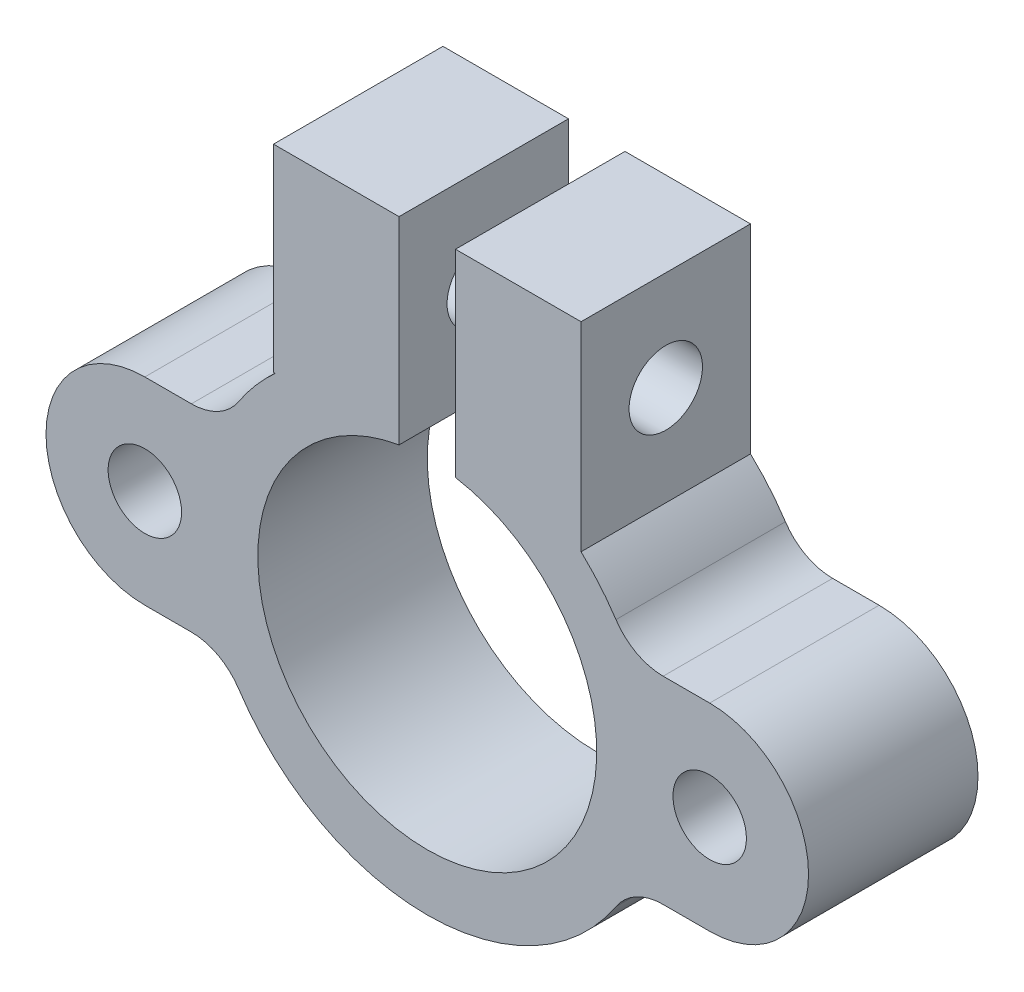
ISO-10303-21;
HEADER;
FILE_DESCRIPTION(('STEP AP214'),'2;1');
FILE_NAME('part.step','',(''),(''),'','','');
FILE_SCHEMA(('AUTOMOTIVE_DESIGN { 1 0 10303 214 1 1 1 1 }'));
ENDSEC;
DATA;
#1=APPLICATION_CONTEXT('core data for automotive mechanical design processes');
#2=APPLICATION_PROTOCOL_DEFINITION('international standard','automotive_design',2000,#1);
#3=PRODUCT_CONTEXT('',#1,'mechanical');
#4=PRODUCT('Part','Part','',(#3));
#5=PRODUCT_RELATED_PRODUCT_CATEGORY('part','',(#4));
#6=PRODUCT_DEFINITION_FORMATION('','',#4);
#7=PRODUCT_DEFINITION_CONTEXT('part definition',#1,'design');
#8=PRODUCT_DEFINITION('design','',#6,#7);
#9=PRODUCT_DEFINITION_SHAPE('','',#8);
#10=(LENGTH_UNIT() NAMED_UNIT(*) SI_UNIT(.MILLI.,.METRE.));
#11=(NAMED_UNIT(*) PLANE_ANGLE_UNIT() SI_UNIT($,.RADIAN.));
#12=(NAMED_UNIT(*) SI_UNIT($,.STERADIAN.) SOLID_ANGLE_UNIT());
#13=UNCERTAINTY_MEASURE_WITH_UNIT(LENGTH_MEASURE(1.E-05),#10,'distance_accuracy_value','');
#14=(GEOMETRIC_REPRESENTATION_CONTEXT(3) GLOBAL_UNCERTAINTY_ASSIGNED_CONTEXT((#13)) GLOBAL_UNIT_ASSIGNED_CONTEXT((#10,
#11,#12)) REPRESENTATION_CONTEXT('',''));
#15=CARTESIAN_POINT('',(0.,0.,0.));
#16=DIRECTION('',(0.,0.,1.));
#17=DIRECTION('',(1.,0.,0.));
#18=AXIS2_PLACEMENT_3D('',#15,#16,#17);
#19=CARTESIAN_POINT('',(0.,0.,6.));
#20=DIRECTION('',(0.,0.,1.));
#21=DIRECTION('',(1.,0.,0.));
#22=AXIS2_PLACEMENT_3D('',#19,#20,#21);
#23=PLANE('',#22);
#24=CARTESIAN_POINT('',(-10.,0.,6.));
#25=DIRECTION('',(0.,0.,1.));
#26=DIRECTION('',(1.,0.,0.));
#27=AXIS2_PLACEMENT_3D('',#24,#25,#26);
#28=CIRCLE('',#27,1.3);
#29=CARTESIAN_POINT('',(-8.7,0.,6.));
#30=VERTEX_POINT('',#29);
#31=EDGE_CURVE('E213',#30,#30,#28,.T.);
#32=ORIENTED_EDGE('',*,*,#31,.F.);
#33=EDGE_LOOP('',(#32));
#34=FACE_BOUND('',#33,.T.);
#35=CARTESIAN_POINT('',(0.,0.,6.));
#36=DIRECTION('',(0.,0.,-1.));
#37=DIRECTION('',(1.,0.,0.));
#38=AXIS2_PLACEMENT_3D('',#35,#36,#37);
#39=CIRCLE('',#38,6.);
#40=CARTESIAN_POINT('',(1.,5.91607978309962,6.));
#41=VERTEX_POINT('',#40);
#42=CARTESIAN_POINT('',(-1.,5.91607978309962,6.));
#43=VERTEX_POINT('',#42);
#44=EDGE_CURVE('E250',#41,#43,#39,.T.);
#45=ORIENTED_EDGE('',*,*,#44,.T.);
#46=DIRECTION('',(0.,1.,0.));
#47=VECTOR('',#46,1.);
#48=CARTESIAN_POINT('',(-1.,12.9160797830996,6.));
#49=LINE('',#48,#47);
#50=CARTESIAN_POINT('',(-1.,12.9160797830996,6.));
#51=VERTEX_POINT('',#50);
#52=EDGE_CURVE('E133',#43,#51,#49,.T.);
#53=ORIENTED_EDGE('',*,*,#52,.T.);
#54=DIRECTION('',(-1.,0.,0.));
#55=VECTOR('',#54,1.);
#56=CARTESIAN_POINT('',(-1.,12.9160797830996,6.));
#57=LINE('',#56,#55);
#58=CARTESIAN_POINT('',(-5.4447751227269,12.9160797830996,6.));
#59=VERTEX_POINT('',#58);
#60=EDGE_CURVE('E305',#51,#59,#57,.T.);
#61=ORIENTED_EDGE('',*,*,#60,.T.);
#62=DIRECTION('',(0.,-1.,0.));
#63=VECTOR('',#62,1.);
#64=CARTESIAN_POINT('',(-5.4447751227269,5.91607978309962,6.));
#65=LINE('',#64,#63);
#66=CARTESIAN_POINT('',(-5.4447751227269,5.91607978309962,6.));
#67=VERTEX_POINT('',#66);
#68=EDGE_CURVE('E324',#59,#67,#65,.T.);
#69=ORIENTED_EDGE('',*,*,#68,.T.);
#70=DIRECTION('',(1.,0.,0.));
#71=VECTOR('',#70,1.);
#72=CARTESIAN_POINT('',(-5.3851648071345,5.91607978309962,6.));
#73=LINE('',#72,#71);
#74=CARTESIAN_POINT('',(-5.3851648071345,5.91607978309962,6.));
#75=VERTEX_POINT('',#74);
#76=EDGE_CURVE('E321',#67,#75,#73,.T.);
#77=ORIENTED_EDGE('',*,*,#76,.T.);
#78=CARTESIAN_POINT('',(0.,0.,6.));
#79=DIRECTION('',(0.,0.,1.));
#80=DIRECTION('',(1.,0.,0.));
#81=AXIS2_PLACEMENT_3D('',#78,#79,#80);
#82=CIRCLE('',#81,8.);
#83=CARTESIAN_POINT('',(-6.68131723539603,4.4,6.));
#84=VERTEX_POINT('',#83);
#85=EDGE_CURVE('E323',#75,#84,#82,.T.);
#86=ORIENTED_EDGE('',*,*,#85,.T.);
#87=CARTESIAN_POINT('',(-8.35164654424504,5.5,6.));
#88=DIRECTION('',(0.,0.,-1.));
#89=DIRECTION('',(-1.,0.,0.));
#90=AXIS2_PLACEMENT_3D('',#87,#88,#89);
#91=CIRCLE('',#90,2.);
#92=CARTESIAN_POINT('',(-8.35164654424504,3.5,6.));
#93=VERTEX_POINT('',#92);
#94=EDGE_CURVE('E326',#84,#93,#91,.T.);
#95=ORIENTED_EDGE('',*,*,#94,.T.);
#96=DIRECTION('',(-1.,0.,0.));
#97=VECTOR('',#96,1.);
#98=CARTESIAN_POINT('',(-10.,3.5,6.));
#99=LINE('',#98,#97);
#100=CARTESIAN_POINT('',(-10.,3.5,6.));
#101=VERTEX_POINT('',#100);
#102=EDGE_CURVE('E332',#93,#101,#99,.T.);
#103=ORIENTED_EDGE('',*,*,#102,.T.);
#104=CARTESIAN_POINT('',(-10.,0.,6.));
#105=DIRECTION('',(0.,0.,1.));
#106=DIRECTION('',(1.,0.,0.));
#107=AXIS2_PLACEMENT_3D('',#104,#105,#106);
#108=CIRCLE('',#107,3.5);
#109=CARTESIAN_POINT('',(-10.,-3.5,6.));
#110=VERTEX_POINT('',#109);
#111=EDGE_CURVE('E334',#101,#110,#108,.T.);
#112=ORIENTED_EDGE('',*,*,#111,.T.);
#113=DIRECTION('',(1.,0.,0.));
#114=VECTOR('',#113,1.);
#115=CARTESIAN_POINT('',(-10.,-3.5,6.));
#116=LINE('',#115,#114);
#117=CARTESIAN_POINT('',(-8.35164654424504,-3.5,6.));
#118=VERTEX_POINT('',#117);
#119=EDGE_CURVE('E336',#110,#118,#116,.T.);
#120=ORIENTED_EDGE('',*,*,#119,.T.);
#121=CARTESIAN_POINT('',(-8.35164654424504,-5.5,6.));
#122=DIRECTION('',(0.,0.,-1.));
#123=DIRECTION('',(1.,0.,0.));
#124=AXIS2_PLACEMENT_3D('',#121,#122,#123);
#125=CIRCLE('',#124,2.);
#126=CARTESIAN_POINT('',(-6.68131723539603,-4.4,6.));
#127=VERTEX_POINT('',#126);
#128=EDGE_CURVE('E338',#118,#127,#125,.T.);
#129=ORIENTED_EDGE('',*,*,#128,.T.);
#130=CARTESIAN_POINT('',(0.,0.,6.));
#131=DIRECTION('',(0.,0.,1.));
#132=DIRECTION('',(1.,0.,0.));
#133=AXIS2_PLACEMENT_3D('',#130,#131,#132);
#134=CIRCLE('',#133,8.);
#135=CARTESIAN_POINT('',(6.68131723539603,-4.4,6.));
#136=VERTEX_POINT('',#135);
#137=EDGE_CURVE('E340',#127,#136,#134,.T.);
#138=ORIENTED_EDGE('',*,*,#137,.T.);
#139=CARTESIAN_POINT('',(8.35164654424504,-5.49999999999999,6.));
#140=DIRECTION('',(0.,0.,-1.));
#141=DIRECTION('',(1.,0.,0.));
#142=AXIS2_PLACEMENT_3D('',#139,#140,#141);
#143=CIRCLE('',#142,2.);
#144=CARTESIAN_POINT('',(8.35164654424504,-3.49999999999999,6.));
#145=VERTEX_POINT('',#144);
#146=EDGE_CURVE('E342',#136,#145,#143,.T.);
#147=ORIENTED_EDGE('',*,*,#146,.T.);
#148=DIRECTION('',(1.,0.,0.));
#149=VECTOR('',#148,1.);
#150=CARTESIAN_POINT('',(8.35164654424504,-3.49999999999999,6.));
#151=LINE('',#150,#149);
#152=CARTESIAN_POINT('',(10.,-3.5,6.));
#153=VERTEX_POINT('',#152);
#154=EDGE_CURVE('E344',#145,#153,#151,.T.);
#155=ORIENTED_EDGE('',*,*,#154,.T.);
#156=CARTESIAN_POINT('',(10.,0.,6.));
#157=DIRECTION('',(0.,0.,1.));
#158=DIRECTION('',(1.,0.,0.));
#159=AXIS2_PLACEMENT_3D('',#156,#157,#158);
#160=CIRCLE('',#159,3.5);
#161=CARTESIAN_POINT('',(10.,3.5,6.));
#162=VERTEX_POINT('',#161);
#163=EDGE_CURVE('E346',#153,#162,#160,.T.);
#164=ORIENTED_EDGE('',*,*,#163,.T.);
#165=DIRECTION('',(-1.,0.,0.));
#166=VECTOR('',#165,1.);
#167=CARTESIAN_POINT('',(8.35164654424504,3.5,6.));
#168=LINE('',#167,#166);
#169=CARTESIAN_POINT('',(8.35164654424504,3.5,6.));
#170=VERTEX_POINT('',#169);
#171=EDGE_CURVE('E348',#162,#170,#168,.T.);
#172=ORIENTED_EDGE('',*,*,#171,.T.);
#173=CARTESIAN_POINT('',(8.35164654424504,5.5,6.));
#174=DIRECTION('',(0.,0.,-1.));
#175=DIRECTION('',(1.,0.,0.));
#176=AXIS2_PLACEMENT_3D('',#173,#174,#175);
#177=CIRCLE('',#176,2.);
#178=CARTESIAN_POINT('',(6.68131723539603,4.4,6.));
#179=VERTEX_POINT('',#178);
#180=EDGE_CURVE('E350',#170,#179,#177,.T.);
#181=ORIENTED_EDGE('',*,*,#180,.T.);
#182=CARTESIAN_POINT('',(0.,0.,6.));
#183=DIRECTION('',(0.,0.,1.));
#184=DIRECTION('',(1.,0.,0.));
#185=AXIS2_PLACEMENT_3D('',#182,#183,#184);
#186=CIRCLE('',#185,8.);
#187=CARTESIAN_POINT('',(5.44477512272691,5.86126469824851,6.));
#188=VERTEX_POINT('',#187);
#189=EDGE_CURVE('E191',#179,#188,#186,.T.);
#190=ORIENTED_EDGE('',*,*,#189,.T.);
#191=DIRECTION('',(0.,1.,0.));
#192=VECTOR('',#191,1.);
#193=CARTESIAN_POINT('',(5.44477512272691,12.9160797830996,6.));
#194=LINE('',#193,#192);
#195=CARTESIAN_POINT('',(5.44477512272691,12.9160797830996,6.));
#196=VERTEX_POINT('',#195);
#197=EDGE_CURVE('E185',#188,#196,#194,.T.);
#198=ORIENTED_EDGE('',*,*,#197,.T.);
#199=DIRECTION('',(-1.,0.,0.));
#200=VECTOR('',#199,1.);
#201=CARTESIAN_POINT('',(1.,12.9160797830996,6.));
#202=LINE('',#201,#200);
#203=CARTESIAN_POINT('',(1.,12.9160797830996,6.));
#204=VERTEX_POINT('',#203);
#205=EDGE_CURVE('E189',#196,#204,#202,.T.);
#206=ORIENTED_EDGE('',*,*,#205,.T.);
#207=DIRECTION('',(0.,-1.,0.));
#208=VECTOR('',#207,1.);
#209=CARTESIAN_POINT('',(1.,12.9160797830996,6.));
#210=LINE('',#209,#208);
#211=EDGE_CURVE('E51',#204,#41,#210,.T.);
#212=ORIENTED_EDGE('',*,*,#211,.T.);
#213=EDGE_LOOP('',(#45,#53,#61,#69,#77,#86,#95,#103,#112,#120,#129,#138,#147,#155,#164,#172,
#181,#190,#198,#206,#212));
#214=FACE_BOUND('',#213,.T.);
#215=CARTESIAN_POINT('',(10.,0.,6.));
#216=DIRECTION('',(0.,0.,1.));
#217=DIRECTION('',(1.,0.,0.));
#218=AXIS2_PLACEMENT_3D('',#215,#216,#217);
#219=CIRCLE('',#218,1.3);
#220=CARTESIAN_POINT('',(11.3,0.,6.));
#221=VERTEX_POINT('',#220);
#222=EDGE_CURVE('E410',#221,#221,#219,.T.);
#223=ORIENTED_EDGE('',*,*,#222,.F.);
#224=EDGE_LOOP('',(#223));
#225=FACE_BOUND('',#224,.T.);
#226=ADVANCED_FACE('F33',(#34,#214,#225),#23,.T.);
#227=CARTESIAN_POINT('',(0.,0.,0.));
#228=DIRECTION('',(0.,0.,1.));
#229=DIRECTION('',(1.,0.,0.));
#230=AXIS2_PLACEMENT_3D('',#227,#228,#229);
#231=PLANE('',#230);
#232=CARTESIAN_POINT('',(-10.,0.,0.));
#233=DIRECTION('',(0.,0.,1.));
#234=DIRECTION('',(1.,0.,0.));
#235=AXIS2_PLACEMENT_3D('',#232,#233,#234);
#236=CIRCLE('',#235,1.3);
#237=CARTESIAN_POINT('',(-8.7,0.,0.));
#238=VERTEX_POINT('',#237);
#239=EDGE_CURVE('E416',#238,#238,#236,.T.);
#240=ORIENTED_EDGE('',*,*,#239,.T.);
#241=EDGE_LOOP('',(#240));
#242=FACE_BOUND('',#241,.T.);
#243=CARTESIAN_POINT('',(0.,0.,0.));
#244=DIRECTION('',(0.,0.,-1.));
#245=DIRECTION('',(1.,0.,0.));
#246=AXIS2_PLACEMENT_3D('',#243,#244,#245);
#247=CIRCLE('',#246,6.);
#248=CARTESIAN_POINT('',(1.,5.91607978309962,0.));
#249=VERTEX_POINT('',#248);
#250=CARTESIAN_POINT('',(-1.,5.91607978309962,0.));
#251=VERTEX_POINT('',#250);
#252=EDGE_CURVE('E209',#249,#251,#247,.T.);
#253=ORIENTED_EDGE('',*,*,#252,.F.);
#254=DIRECTION('',(0.,-1.,0.));
#255=VECTOR('',#254,1.);
#256=CARTESIAN_POINT('',(1.,12.9160797830996,0.));
#257=LINE('',#256,#255);
#258=CARTESIAN_POINT('',(1.,12.9160797830996,0.));
#259=VERTEX_POINT('',#258);
#260=EDGE_CURVE('E125',#259,#249,#257,.T.);
#261=ORIENTED_EDGE('',*,*,#260,.F.);
#262=DIRECTION('',(-1.,0.,0.));
#263=VECTOR('',#262,1.);
#264=CARTESIAN_POINT('',(1.,12.9160797830996,0.));
#265=LINE('',#264,#263);
#266=CARTESIAN_POINT('',(5.44477512272691,12.9160797830996,0.));
#267=VERTEX_POINT('',#266);
#268=EDGE_CURVE('E119',#267,#259,#265,.T.);
#269=ORIENTED_EDGE('',*,*,#268,.F.);
#270=DIRECTION('',(0.,1.,0.));
#271=VECTOR('',#270,1.);
#272=CARTESIAN_POINT('',(5.44477512272691,12.9160797830996,0.));
#273=LINE('',#272,#271);
#274=CARTESIAN_POINT('',(5.44477512272691,5.86126469824851,0.));
#275=VERTEX_POINT('',#274);
#276=EDGE_CURVE('E199',#275,#267,#273,.T.);
#277=ORIENTED_EDGE('',*,*,#276,.F.);
#278=CARTESIAN_POINT('',(0.,0.,0.));
#279=DIRECTION('',(0.,0.,1.));
#280=DIRECTION('',(1.,0.,0.));
#281=AXIS2_PLACEMENT_3D('',#278,#279,#280);
#282=CIRCLE('',#281,8.);
#283=CARTESIAN_POINT('',(6.68131723539603,4.4,0.));
#284=VERTEX_POINT('',#283);
#285=EDGE_CURVE('E245',#284,#275,#282,.T.);
#286=ORIENTED_EDGE('',*,*,#285,.F.);
#287=CARTESIAN_POINT('',(8.35164654424504,5.5,0.));
#288=DIRECTION('',(0.,0.,-1.));
#289=DIRECTION('',(1.,0.,0.));
#290=AXIS2_PLACEMENT_3D('',#287,#288,#289);
#291=CIRCLE('',#290,2.);
#292=CARTESIAN_POINT('',(8.35164654424504,3.5,0.));
#293=VERTEX_POINT('',#292);
#294=EDGE_CURVE('E243',#293,#284,#291,.T.);
#295=ORIENTED_EDGE('',*,*,#294,.F.);
#296=DIRECTION('',(-1.,0.,0.));
#297=VECTOR('',#296,1.);
#298=CARTESIAN_POINT('',(8.35164654424504,3.5,0.));
#299=LINE('',#298,#297);
#300=CARTESIAN_POINT('',(10.,3.5,0.));
#301=VERTEX_POINT('',#300);
#302=EDGE_CURVE('E241',#301,#293,#299,.T.);
#303=ORIENTED_EDGE('',*,*,#302,.F.);
#304=CARTESIAN_POINT('',(10.,0.,0.));
#305=DIRECTION('',(0.,0.,1.));
#306=DIRECTION('',(1.,0.,0.));
#307=AXIS2_PLACEMENT_3D('',#304,#305,#306);
#308=CIRCLE('',#307,3.5);
#309=CARTESIAN_POINT('',(10.,-3.5,0.));
#310=VERTEX_POINT('',#309);
#311=EDGE_CURVE('E239',#310,#301,#308,.T.);
#312=ORIENTED_EDGE('',*,*,#311,.F.);
#313=DIRECTION('',(1.,0.,0.));
#314=VECTOR('',#313,1.);
#315=CARTESIAN_POINT('',(8.35164654424504,-3.49999999999999,0.));
#316=LINE('',#315,#314);
#317=CARTESIAN_POINT('',(8.35164654424504,-3.49999999999999,0.));
#318=VERTEX_POINT('',#317);
#319=EDGE_CURVE('E237',#318,#310,#316,.T.);
#320=ORIENTED_EDGE('',*,*,#319,.F.);
#321=CARTESIAN_POINT('',(8.35164654424504,-5.49999999999999,0.));
#322=DIRECTION('',(0.,0.,-1.));
#323=DIRECTION('',(1.,0.,0.));
#324=AXIS2_PLACEMENT_3D('',#321,#322,#323);
#325=CIRCLE('',#324,2.);
#326=CARTESIAN_POINT('',(6.68131723539603,-4.4,0.));
#327=VERTEX_POINT('',#326);
#328=EDGE_CURVE('E235',#327,#318,#325,.T.);
#329=ORIENTED_EDGE('',*,*,#328,.F.);
#330=CARTESIAN_POINT('',(0.,0.,0.));
#331=DIRECTION('',(0.,0.,1.));
#332=DIRECTION('',(1.,0.,0.));
#333=AXIS2_PLACEMENT_3D('',#330,#331,#332);
#334=CIRCLE('',#333,8.);
#335=CARTESIAN_POINT('',(-6.68131723539603,-4.4,0.));
#336=VERTEX_POINT('',#335);
#337=EDGE_CURVE('E233',#336,#327,#334,.T.);
#338=ORIENTED_EDGE('',*,*,#337,.F.);
#339=CARTESIAN_POINT('',(-8.35164654424504,-5.5,0.));
#340=DIRECTION('',(0.,0.,-1.));
#341=DIRECTION('',(1.,0.,0.));
#342=AXIS2_PLACEMENT_3D('',#339,#340,#341);
#343=CIRCLE('',#342,2.);
#344=CARTESIAN_POINT('',(-8.35164654424504,-3.5,0.));
#345=VERTEX_POINT('',#344);
#346=EDGE_CURVE('E231',#345,#336,#343,.T.);
#347=ORIENTED_EDGE('',*,*,#346,.F.);
#348=DIRECTION('',(1.,0.,0.));
#349=VECTOR('',#348,1.);
#350=CARTESIAN_POINT('',(-10.,-3.5,0.));
#351=LINE('',#350,#349);
#352=CARTESIAN_POINT('',(-10.,-3.5,0.));
#353=VERTEX_POINT('',#352);
#354=EDGE_CURVE('E229',#353,#345,#351,.T.);
#355=ORIENTED_EDGE('',*,*,#354,.F.);
#356=CARTESIAN_POINT('',(-10.,0.,0.));
#357=DIRECTION('',(0.,0.,1.));
#358=DIRECTION('',(1.,0.,0.));
#359=AXIS2_PLACEMENT_3D('',#356,#357,#358);
#360=CIRCLE('',#359,3.5);
#361=CARTESIAN_POINT('',(-10.,3.5,0.));
#362=VERTEX_POINT('',#361);
#363=EDGE_CURVE('E227',#362,#353,#360,.T.);
#364=ORIENTED_EDGE('',*,*,#363,.F.);
#365=DIRECTION('',(-1.,0.,0.));
#366=VECTOR('',#365,1.);
#367=CARTESIAN_POINT('',(-10.,3.5,0.));
#368=LINE('',#367,#366);
#369=CARTESIAN_POINT('',(-8.35164654424504,3.5,0.));
#370=VERTEX_POINT('',#369);
#371=EDGE_CURVE('E225',#370,#362,#368,.T.);
#372=ORIENTED_EDGE('',*,*,#371,.F.);
#373=CARTESIAN_POINT('',(-8.35164654424504,5.5,0.));
#374=DIRECTION('',(0.,0.,-1.));
#375=DIRECTION('',(-1.,0.,0.));
#376=AXIS2_PLACEMENT_3D('',#373,#374,#375);
#377=CIRCLE('',#376,2.);
#378=CARTESIAN_POINT('',(-6.68131723539603,4.4,0.));
#379=VERTEX_POINT('',#378);
#380=EDGE_CURVE('E223',#379,#370,#377,.T.);
#381=ORIENTED_EDGE('',*,*,#380,.F.);
#382=CARTESIAN_POINT('',(0.,0.,0.));
#383=DIRECTION('',(0.,0.,1.));
#384=DIRECTION('',(1.,0.,0.));
#385=AXIS2_PLACEMENT_3D('',#382,#383,#384);
#386=CIRCLE('',#385,8.);
#387=CARTESIAN_POINT('',(-5.3851648071345,5.91607978309962,0.));
#388=VERTEX_POINT('',#387);
#389=EDGE_CURVE('E221',#388,#379,#386,.T.);
#390=ORIENTED_EDGE('',*,*,#389,.F.);
#391=DIRECTION('',(1.,0.,0.));
#392=VECTOR('',#391,1.);
#393=CARTESIAN_POINT('',(-5.3851648071345,5.91607978309962,0.));
#394=LINE('',#393,#392);
#395=CARTESIAN_POINT('',(-5.4447751227269,5.91607978309962,0.));
#396=VERTEX_POINT('',#395);
#397=EDGE_CURVE('E219',#396,#388,#394,.T.);
#398=ORIENTED_EDGE('',*,*,#397,.F.);
#399=DIRECTION('',(0.,-1.,0.));
#400=VECTOR('',#399,1.);
#401=CARTESIAN_POINT('',(-5.4447751227269,5.91607978309962,0.));
#402=LINE('',#401,#400);
#403=CARTESIAN_POINT('',(-5.4447751227269,12.9160797830996,0.));
#404=VERTEX_POINT('',#403);
#405=EDGE_CURVE('E217',#404,#396,#402,.T.);
#406=ORIENTED_EDGE('',*,*,#405,.F.);
#407=DIRECTION('',(-1.,0.,0.));
#408=VECTOR('',#407,1.);
#409=CARTESIAN_POINT('',(-1.,12.9160797830996,0.));
#410=LINE('',#409,#408);
#411=CARTESIAN_POINT('',(-1.,12.9160797830996,0.));
#412=VERTEX_POINT('',#411);
#413=EDGE_CURVE('E215',#412,#404,#410,.T.);
#414=ORIENTED_EDGE('',*,*,#413,.F.);
#415=DIRECTION('',(0.,1.,0.));
#416=VECTOR('',#415,1.);
#417=CARTESIAN_POINT('',(-1.,12.9160797830996,0.));
#418=LINE('',#417,#416);
#419=EDGE_CURVE('E212',#251,#412,#418,.T.);
#420=ORIENTED_EDGE('',*,*,#419,.F.);
#421=EDGE_LOOP('',(#253,#261,#269,#277,#286,#295,#303,#312,#320,#329,#338,#347,#355,#364,#372,
#381,#390,#398,#406,#414,#420));
#422=FACE_BOUND('',#421,.T.);
#423=CARTESIAN_POINT('',(10.,0.,0.));
#424=DIRECTION('',(0.,0.,1.));
#425=DIRECTION('',(1.,0.,0.));
#426=AXIS2_PLACEMENT_3D('',#423,#424,#425);
#427=CIRCLE('',#426,1.3);
#428=CARTESIAN_POINT('',(11.3,0.,0.));
#429=VERTEX_POINT('',#428);
#430=EDGE_CURVE('E407',#429,#429,#427,.T.);
#431=ORIENTED_EDGE('',*,*,#430,.T.);
#432=EDGE_LOOP('',(#431));
#433=FACE_BOUND('',#432,.T.);
#434=ADVANCED_FACE('F309',(#242,#422,#433),#231,.F.);
#435=CARTESIAN_POINT('',(0.,0.,6.));
#436=DIRECTION('',(0.,0.,-1.));
#437=DIRECTION('',(-1.,0.,0.));
#438=AXIS2_PLACEMENT_3D('',#435,#436,#437);
#439=CYLINDRICAL_SURFACE('',#438,6.);
#440=ORIENTED_EDGE('',*,*,#252,.T.);
#441=DIRECTION('',(0.,0.,-1.));
#442=VECTOR('',#441,1.);
#443=CARTESIAN_POINT('',(-1.,5.91607978309962,6.));
#444=LINE('',#443,#442);
#445=EDGE_CURVE('E11',#43,#251,#444,.T.);
#446=ORIENTED_EDGE('',*,*,#445,.F.);
#447=ORIENTED_EDGE('',*,*,#44,.F.);
#448=DIRECTION('',(0.,0.,-1.));
#449=VECTOR('',#448,1.);
#450=CARTESIAN_POINT('',(1.,5.91607978309962,6.));
#451=LINE('',#450,#449);
#452=EDGE_CURVE('E205',#41,#249,#451,.T.);
#453=ORIENTED_EDGE('',*,*,#452,.T.);
#454=EDGE_LOOP('',(#440,#446,#447,#453));
#455=FACE_BOUND('',#454,.T.);
#456=ADVANCED_FACE('F35',(#455),#439,.F.);
#457=CARTESIAN_POINT('',(-1.,12.9160797830996,6.));
#458=DIRECTION('',(-1.,0.,0.));
#459=DIRECTION('',(0.,-1.,0.));
#460=AXIS2_PLACEMENT_3D('',#457,#458,#459);
#461=PLANE('',#460);
#462=CARTESIAN_POINT('',(-1.,9.38867224067406,3.));
#463=DIRECTION('',(-1.,0.,0.));
#464=DIRECTION('',(0.,-1.,0.));
#465=AXIS2_PLACEMENT_3D('',#462,#463,#464);
#466=CIRCLE('',#465,1.3);
#467=CARTESIAN_POINT('',(-1.,8.08867224067406,3.));
#468=VERTEX_POINT('',#467);
#469=EDGE_CURVE('E405',#468,#468,#466,.T.);
#470=ORIENTED_EDGE('',*,*,#469,.T.);
#471=EDGE_LOOP('',(#470));
#472=FACE_BOUND('',#471,.T.);
#473=ORIENTED_EDGE('',*,*,#419,.T.);
#474=DIRECTION('',(0.,0.,-1.));
#475=VECTOR('',#474,1.);
#476=CARTESIAN_POINT('',(-1.,12.9160797830996,6.));
#477=LINE('',#476,#475);
#478=EDGE_CURVE('E43',#51,#412,#477,.T.);
#479=ORIENTED_EDGE('',*,*,#478,.F.);
#480=ORIENTED_EDGE('',*,*,#52,.F.);
#481=ORIENTED_EDGE('',*,*,#445,.T.);
#482=EDGE_LOOP('',(#473,#479,#480,#481));
#483=FACE_BOUND('',#482,.T.);
#484=ADVANCED_FACE('F493',(#472,#483),#461,.F.);
#485=CARTESIAN_POINT('',(-1.,12.9160797830996,6.));
#486=DIRECTION('',(0.,-1.,0.));
#487=DIRECTION('',(0.,0.,-1.));
#488=AXIS2_PLACEMENT_3D('',#485,#486,#487);
#489=PLANE('',#488);
#490=ORIENTED_EDGE('',*,*,#413,.T.);
#491=DIRECTION('',(0.,0.,-1.));
#492=VECTOR('',#491,1.);
#493=CARTESIAN_POINT('',(-5.4447751227269,12.9160797830996,6.));
#494=LINE('',#493,#492);
#495=EDGE_CURVE('E296',#59,#404,#494,.T.);
#496=ORIENTED_EDGE('',*,*,#495,.F.);
#497=ORIENTED_EDGE('',*,*,#60,.F.);
#498=ORIENTED_EDGE('',*,*,#478,.T.);
#499=EDGE_LOOP('',(#490,#496,#497,#498));
#500=FACE_BOUND('',#499,.T.);
#501=ADVANCED_FACE('F303',(#500),#489,.F.);
#502=CARTESIAN_POINT('',(-5.4447751227269,5.91607978309962,6.));
#503=DIRECTION('',(1.,0.,0.));
#504=DIRECTION('',(0.,0.,-1.));
#505=AXIS2_PLACEMENT_3D('',#502,#503,#504);
#506=PLANE('',#505);
#507=CARTESIAN_POINT('',(-5.4447751227269,9.38867224067406,3.));
#508=DIRECTION('',(1.,0.,0.));
#509=DIRECTION('',(0.,0.,-1.));
#510=AXIS2_PLACEMENT_3D('',#507,#508,#509);
#511=CIRCLE('',#510,1.3);
#512=CARTESIAN_POINT('',(-5.4447751227269,9.38867224067406,1.7));
#513=VERTEX_POINT('',#512);
#514=EDGE_CURVE('E402',#513,#513,#511,.T.);
#515=ORIENTED_EDGE('',*,*,#514,.T.);
#516=EDGE_LOOP('',(#515));
#517=FACE_BOUND('',#516,.T.);
#518=ORIENTED_EDGE('',*,*,#405,.T.);
#519=DIRECTION('',(0.,0.,-1.));
#520=VECTOR('',#519,1.);
#521=CARTESIAN_POINT('',(-5.4447751227269,5.91607978309962,6.));
#522=LINE('',#521,#520);
#523=EDGE_CURVE('E293',#67,#396,#522,.T.);
#524=ORIENTED_EDGE('',*,*,#523,.F.);
#525=ORIENTED_EDGE('',*,*,#68,.F.);
#526=ORIENTED_EDGE('',*,*,#495,.T.);
#527=EDGE_LOOP('',(#518,#524,#525,#526));
#528=FACE_BOUND('',#527,.T.);
#529=ADVANCED_FACE('F315',(#517,#528),#506,.F.);
#530=CARTESIAN_POINT('',(-5.3851648071345,5.91607978309962,6.));
#531=DIRECTION('',(0.,1.,0.));
#532=DIRECTION('',(0.,0.,1.));
#533=AXIS2_PLACEMENT_3D('',#530,#531,#532);
#534=PLANE('',#533);
#535=ORIENTED_EDGE('',*,*,#397,.T.);
#536=DIRECTION('',(0.,0.,-1.));
#537=VECTOR('',#536,1.);
#538=CARTESIAN_POINT('',(-5.3851648071345,5.91607978309962,6.));
#539=LINE('',#538,#537);
#540=EDGE_CURVE('E290',#75,#388,#539,.T.);
#541=ORIENTED_EDGE('',*,*,#540,.F.);
#542=ORIENTED_EDGE('',*,*,#76,.F.);
#543=ORIENTED_EDGE('',*,*,#523,.T.);
#544=EDGE_LOOP('',(#535,#541,#542,#543));
#545=FACE_BOUND('',#544,.T.);
#546=ADVANCED_FACE('F319',(#545),#534,.F.);
#547=CARTESIAN_POINT('',(0.,0.,6.));
#548=DIRECTION('',(0.,0.,-1.));
#549=DIRECTION('',(-1.,0.,0.));
#550=AXIS2_PLACEMENT_3D('',#547,#548,#549);
#551=CYLINDRICAL_SURFACE('',#550,8.);
#552=ORIENTED_EDGE('',*,*,#389,.T.);
#553=DIRECTION('',(0.,0.,-1.));
#554=VECTOR('',#553,1.);
#555=CARTESIAN_POINT('',(-6.68131723539603,4.4,6.));
#556=LINE('',#555,#554);
#557=EDGE_CURVE('E287',#84,#379,#556,.T.);
#558=ORIENTED_EDGE('',*,*,#557,.F.);
#559=ORIENTED_EDGE('',*,*,#85,.F.);
#560=ORIENTED_EDGE('',*,*,#540,.T.);
#561=EDGE_LOOP('',(#552,#558,#559,#560));
#562=FACE_BOUND('',#561,.T.);
#563=ADVANCED_FACE('F482',(#562),#551,.T.);
#564=CARTESIAN_POINT('',(-8.35164654424504,5.5,6.));
#565=DIRECTION('',(0.,0.,-1.));
#566=DIRECTION('',(-1.,0.,0.));
#567=AXIS2_PLACEMENT_3D('',#564,#565,#566);
#568=CYLINDRICAL_SURFACE('',#567,2.);
#569=ORIENTED_EDGE('',*,*,#380,.T.);
#570=DIRECTION('',(0.,0.,-1.));
#571=VECTOR('',#570,1.);
#572=CARTESIAN_POINT('',(-8.35164654424504,3.5,6.));
#573=LINE('',#572,#571);
#574=EDGE_CURVE('E284',#93,#370,#573,.T.);
#575=ORIENTED_EDGE('',*,*,#574,.F.);
#576=ORIENTED_EDGE('',*,*,#94,.F.);
#577=ORIENTED_EDGE('',*,*,#557,.T.);
#578=EDGE_LOOP('',(#569,#575,#576,#577));
#579=FACE_BOUND('',#578,.T.);
#580=ADVANCED_FACE('F478',(#579),#568,.F.);
#581=CARTESIAN_POINT('',(-10.,3.5,6.));
#582=DIRECTION('',(0.,-1.,0.));
#583=DIRECTION('',(1.,0.,0.));
#584=AXIS2_PLACEMENT_3D('',#581,#582,#583);
#585=PLANE('',#584);
#586=ORIENTED_EDGE('',*,*,#371,.T.);
#587=DIRECTION('',(0.,0.,-1.));
#588=VECTOR('',#587,1.);
#589=CARTESIAN_POINT('',(-10.,3.5,6.));
#590=LINE('',#589,#588);
#591=EDGE_CURVE('E281',#101,#362,#590,.T.);
#592=ORIENTED_EDGE('',*,*,#591,.F.);
#593=ORIENTED_EDGE('',*,*,#102,.F.);
#594=ORIENTED_EDGE('',*,*,#574,.T.);
#595=EDGE_LOOP('',(#586,#592,#593,#594));
#596=FACE_BOUND('',#595,.T.);
#597=ADVANCED_FACE('F474',(#596),#585,.F.);
#598=CARTESIAN_POINT('',(-10.,0.,6.));
#599=DIRECTION('',(0.,0.,-1.));
#600=DIRECTION('',(-1.,0.,0.));
#601=AXIS2_PLACEMENT_3D('',#598,#599,#600);
#602=CYLINDRICAL_SURFACE('',#601,3.5);
#603=ORIENTED_EDGE('',*,*,#363,.T.);
#604=DIRECTION('',(0.,0.,-1.));
#605=VECTOR('',#604,1.);
#606=CARTESIAN_POINT('',(-10.,-3.5,6.));
#607=LINE('',#606,#605);
#608=EDGE_CURVE('E278',#110,#353,#607,.T.);
#609=ORIENTED_EDGE('',*,*,#608,.F.);
#610=ORIENTED_EDGE('',*,*,#111,.F.);
#611=ORIENTED_EDGE('',*,*,#591,.T.);
#612=EDGE_LOOP('',(#603,#609,#610,#611));
#613=FACE_BOUND('',#612,.T.);
#614=ADVANCED_FACE('F470',(#613),#602,.T.);
#615=CARTESIAN_POINT('',(-10.,-3.5,6.));
#616=DIRECTION('',(0.,1.,0.));
#617=DIRECTION('',(-1.,0.,0.));
#618=AXIS2_PLACEMENT_3D('',#615,#616,#617);
#619=PLANE('',#618);
#620=ORIENTED_EDGE('',*,*,#354,.T.);
#621=DIRECTION('',(0.,0.,-1.));
#622=VECTOR('',#621,1.);
#623=CARTESIAN_POINT('',(-8.35164654424504,-3.5,6.));
#624=LINE('',#623,#622);
#625=EDGE_CURVE('E275',#118,#345,#624,.T.);
#626=ORIENTED_EDGE('',*,*,#625,.F.);
#627=ORIENTED_EDGE('',*,*,#119,.F.);
#628=ORIENTED_EDGE('',*,*,#608,.T.);
#629=EDGE_LOOP('',(#620,#626,#627,#628));
#630=FACE_BOUND('',#629,.T.);
#631=ADVANCED_FACE('F466',(#630),#619,.F.);
#632=CARTESIAN_POINT('',(-8.35164654424504,-5.5,6.));
#633=DIRECTION('',(0.,0.,-1.));
#634=DIRECTION('',(-1.,0.,0.));
#635=AXIS2_PLACEMENT_3D('',#632,#633,#634);
#636=CYLINDRICAL_SURFACE('',#635,2.);
#637=ORIENTED_EDGE('',*,*,#346,.T.);
#638=DIRECTION('',(0.,0.,-1.));
#639=VECTOR('',#638,1.);
#640=CARTESIAN_POINT('',(-6.68131723539603,-4.4,6.));
#641=LINE('',#640,#639);
#642=EDGE_CURVE('E272',#127,#336,#641,.T.);
#643=ORIENTED_EDGE('',*,*,#642,.F.);
#644=ORIENTED_EDGE('',*,*,#128,.F.);
#645=ORIENTED_EDGE('',*,*,#625,.T.);
#646=EDGE_LOOP('',(#637,#643,#644,#645));
#647=FACE_BOUND('',#646,.T.);
#648=ADVANCED_FACE('F462',(#647),#636,.F.);
#649=CARTESIAN_POINT('',(0.,0.,6.));
#650=DIRECTION('',(0.,0.,-1.));
#651=DIRECTION('',(-1.,0.,0.));
#652=AXIS2_PLACEMENT_3D('',#649,#650,#651);
#653=CYLINDRICAL_SURFACE('',#652,8.);
#654=ORIENTED_EDGE('',*,*,#337,.T.);
#655=DIRECTION('',(0.,0.,-1.));
#656=VECTOR('',#655,1.);
#657=CARTESIAN_POINT('',(6.68131723539603,-4.4,6.));
#658=LINE('',#657,#656);
#659=EDGE_CURVE('E269',#136,#327,#658,.T.);
#660=ORIENTED_EDGE('',*,*,#659,.F.);
#661=ORIENTED_EDGE('',*,*,#137,.F.);
#662=ORIENTED_EDGE('',*,*,#642,.T.);
#663=EDGE_LOOP('',(#654,#660,#661,#662));
#664=FACE_BOUND('',#663,.T.);
#665=ADVANCED_FACE('F458',(#664),#653,.T.);
#666=CARTESIAN_POINT('',(8.35164654424504,-5.49999999999999,6.));
#667=DIRECTION('',(0.,0.,-1.));
#668=DIRECTION('',(-1.,0.,0.));
#669=AXIS2_PLACEMENT_3D('',#666,#667,#668);
#670=CYLINDRICAL_SURFACE('',#669,2.);
#671=ORIENTED_EDGE('',*,*,#328,.T.);
#672=DIRECTION('',(0.,0.,-1.));
#673=VECTOR('',#672,1.);
#674=CARTESIAN_POINT('',(8.35164654424504,-3.49999999999999,6.));
#675=LINE('',#674,#673);
#676=EDGE_CURVE('E266',#145,#318,#675,.T.);
#677=ORIENTED_EDGE('',*,*,#676,.F.);
#678=ORIENTED_EDGE('',*,*,#146,.F.);
#679=ORIENTED_EDGE('',*,*,#659,.T.);
#680=EDGE_LOOP('',(#671,#677,#678,#679));
#681=FACE_BOUND('',#680,.T.);
#682=ADVANCED_FACE('F454',(#681),#670,.F.);
#683=CARTESIAN_POINT('',(8.35164654424504,-3.49999999999999,6.));
#684=DIRECTION('',(0.,1.,0.));
#685=DIRECTION('',(-1.,0.,0.));
#686=AXIS2_PLACEMENT_3D('',#683,#684,#685);
#687=PLANE('',#686);
#688=ORIENTED_EDGE('',*,*,#319,.T.);
#689=DIRECTION('',(0.,0.,-1.));
#690=VECTOR('',#689,1.);
#691=CARTESIAN_POINT('',(10.,-3.5,6.));
#692=LINE('',#691,#690);
#693=EDGE_CURVE('E263',#153,#310,#692,.T.);
#694=ORIENTED_EDGE('',*,*,#693,.F.);
#695=ORIENTED_EDGE('',*,*,#154,.F.);
#696=ORIENTED_EDGE('',*,*,#676,.T.);
#697=EDGE_LOOP('',(#688,#694,#695,#696));
#698=FACE_BOUND('',#697,.T.);
#699=ADVANCED_FACE('F450',(#698),#687,.F.);
#700=CARTESIAN_POINT('',(10.,0.,6.));
#701=DIRECTION('',(0.,0.,-1.));
#702=DIRECTION('',(-1.,0.,0.));
#703=AXIS2_PLACEMENT_3D('',#700,#701,#702);
#704=CYLINDRICAL_SURFACE('',#703,3.5);
#705=ORIENTED_EDGE('',*,*,#311,.T.);
#706=DIRECTION('',(0.,0.,-1.));
#707=VECTOR('',#706,1.);
#708=CARTESIAN_POINT('',(10.,3.5,6.));
#709=LINE('',#708,#707);
#710=EDGE_CURVE('E260',#162,#301,#709,.T.);
#711=ORIENTED_EDGE('',*,*,#710,.F.);
#712=ORIENTED_EDGE('',*,*,#163,.F.);
#713=ORIENTED_EDGE('',*,*,#693,.T.);
#714=EDGE_LOOP('',(#705,#711,#712,#713));
#715=FACE_BOUND('',#714,.T.);
#716=ADVANCED_FACE('F446',(#715),#704,.T.);
#717=CARTESIAN_POINT('',(8.35164654424504,3.5,6.));
#718=DIRECTION('',(0.,-1.,0.));
#719=DIRECTION('',(1.,0.,0.));
#720=AXIS2_PLACEMENT_3D('',#717,#718,#719);
#721=PLANE('',#720);
#722=ORIENTED_EDGE('',*,*,#302,.T.);
#723=DIRECTION('',(0.,0.,-1.));
#724=VECTOR('',#723,1.);
#725=CARTESIAN_POINT('',(8.35164654424504,3.5,6.));
#726=LINE('',#725,#724);
#727=EDGE_CURVE('E257',#170,#293,#726,.T.);
#728=ORIENTED_EDGE('',*,*,#727,.F.);
#729=ORIENTED_EDGE('',*,*,#171,.F.);
#730=ORIENTED_EDGE('',*,*,#710,.T.);
#731=EDGE_LOOP('',(#722,#728,#729,#730));
#732=FACE_BOUND('',#731,.T.);
#733=ADVANCED_FACE('F443',(#732),#721,.F.);
#734=CARTESIAN_POINT('',(8.35164654424504,5.5,6.));
#735=DIRECTION('',(0.,0.,-1.));
#736=DIRECTION('',(-1.,0.,0.));
#737=AXIS2_PLACEMENT_3D('',#734,#735,#736);
#738=CYLINDRICAL_SURFACE('',#737,2.);
#739=ORIENTED_EDGE('',*,*,#294,.T.);
#740=DIRECTION('',(0.,0.,-1.));
#741=VECTOR('',#740,1.);
#742=CARTESIAN_POINT('',(6.68131723539603,4.4,6.));
#743=LINE('',#742,#741);
#744=EDGE_CURVE('E254',#179,#284,#743,.T.);
#745=ORIENTED_EDGE('',*,*,#744,.F.);
#746=ORIENTED_EDGE('',*,*,#180,.F.);
#747=ORIENTED_EDGE('',*,*,#727,.T.);
#748=EDGE_LOOP('',(#739,#745,#746,#747));
#749=FACE_BOUND('',#748,.T.);
#750=ADVANCED_FACE('F356',(#749),#738,.F.);
#751=CARTESIAN_POINT('',(0.,0.,6.));
#752=DIRECTION('',(0.,0.,-1.));
#753=DIRECTION('',(-1.,0.,0.));
#754=AXIS2_PLACEMENT_3D('',#751,#752,#753);
#755=CYLINDRICAL_SURFACE('',#754,8.);
#756=ORIENTED_EDGE('',*,*,#285,.T.);
#757=DIRECTION('',(0.,0.,-1.));
#758=VECTOR('',#757,1.);
#759=CARTESIAN_POINT('',(5.44477512272691,5.86126469824851,6.));
#760=LINE('',#759,#758);
#761=EDGE_CURVE('E200',#188,#275,#760,.T.);
#762=ORIENTED_EDGE('',*,*,#761,.F.);
#763=ORIENTED_EDGE('',*,*,#189,.F.);
#764=ORIENTED_EDGE('',*,*,#744,.T.);
#765=EDGE_LOOP('',(#756,#762,#763,#764));
#766=FACE_BOUND('',#765,.T.);
#767=ADVANCED_FACE('F360',(#766),#755,.T.);
#768=CARTESIAN_POINT('',(5.44477512272691,12.9160797830996,6.));
#769=DIRECTION('',(-1.,0.,0.));
#770=DIRECTION('',(0.,0.,1.));
#771=AXIS2_PLACEMENT_3D('',#768,#769,#770);
#772=PLANE('',#771);
#773=CARTESIAN_POINT('',(5.44477512272691,9.38867224067406,3.));
#774=DIRECTION('',(1.,0.,0.));
#775=DIRECTION('',(0.,0.,-1.));
#776=AXIS2_PLACEMENT_3D('',#773,#774,#775);
#777=CIRCLE('',#776,1.3);
#778=CARTESIAN_POINT('',(5.44477512272691,9.38867224067406,1.7));
#779=VERTEX_POINT('',#778);
#780=EDGE_CURVE('E428',#779,#779,#777,.T.);
#781=ORIENTED_EDGE('',*,*,#780,.F.);
#782=EDGE_LOOP('',(#781));
#783=FACE_BOUND('',#782,.T.);
#784=ORIENTED_EDGE('',*,*,#276,.T.);
#785=DIRECTION('',(0.,0.,-1.));
#786=VECTOR('',#785,1.);
#787=CARTESIAN_POINT('',(5.44477512272691,12.9160797830996,6.));
#788=LINE('',#787,#786);
#789=EDGE_CURVE('E196',#196,#267,#788,.T.);
#790=ORIENTED_EDGE('',*,*,#789,.F.);
#791=ORIENTED_EDGE('',*,*,#197,.F.);
#792=ORIENTED_EDGE('',*,*,#761,.T.);
#793=EDGE_LOOP('',(#784,#790,#791,#792));
#794=FACE_BOUND('',#793,.T.);
#795=ADVANCED_FACE('F197',(#783,#794),#772,.F.);
#796=CARTESIAN_POINT('',(1.,12.9160797830996,6.));
#797=DIRECTION('',(0.,-1.,0.));
#798=DIRECTION('',(1.,0.,0.));
#799=AXIS2_PLACEMENT_3D('',#796,#797,#798);
#800=PLANE('',#799);
#801=ORIENTED_EDGE('',*,*,#268,.T.);
#802=DIRECTION('',(0.,0.,-1.));
#803=VECTOR('',#802,1.);
#804=CARTESIAN_POINT('',(1.,12.9160797830996,6.));
#805=LINE('',#804,#803);
#806=EDGE_CURVE('E201',#204,#259,#805,.T.);
#807=ORIENTED_EDGE('',*,*,#806,.F.);
#808=ORIENTED_EDGE('',*,*,#205,.F.);
#809=ORIENTED_EDGE('',*,*,#789,.T.);
#810=EDGE_LOOP('',(#801,#807,#808,#809));
#811=FACE_BOUND('',#810,.T.);
#812=ADVANCED_FACE('F203',(#811),#800,.F.);
#813=CARTESIAN_POINT('',(1.,12.9160797830996,6.));
#814=DIRECTION('',(1.,0.,0.));
#815=DIRECTION('',(0.,1.,0.));
#816=AXIS2_PLACEMENT_3D('',#813,#814,#815);
#817=PLANE('',#816);
#818=CARTESIAN_POINT('',(1.,9.38867224067406,3.));
#819=DIRECTION('',(1.,0.,0.));
#820=DIRECTION('',(0.,1.,0.));
#821=AXIS2_PLACEMENT_3D('',#818,#819,#820);
#822=CIRCLE('',#821,1.3);
#823=CARTESIAN_POINT('',(1.,10.6886722406741,3.));
#824=VERTEX_POINT('',#823);
#825=EDGE_CURVE('E37',#824,#824,#822,.T.);
#826=ORIENTED_EDGE('',*,*,#825,.T.);
#827=EDGE_LOOP('',(#826));
#828=FACE_BOUND('',#827,.T.);
#829=ORIENTED_EDGE('',*,*,#260,.T.);
#830=ORIENTED_EDGE('',*,*,#452,.F.);
#831=ORIENTED_EDGE('',*,*,#211,.F.);
#832=ORIENTED_EDGE('',*,*,#806,.T.);
#833=EDGE_LOOP('',(#829,#830,#831,#832));
#834=FACE_BOUND('',#833,.T.);
#835=ADVANCED_FACE('F364',(#828,#834),#817,.F.);
#836=CARTESIAN_POINT('',(-10.,0.,6.));
#837=DIRECTION('',(0.,0.,-1.));
#838=DIRECTION('',(-1.,0.,0.));
#839=AXIS2_PLACEMENT_3D('',#836,#837,#838);
#840=CYLINDRICAL_SURFACE('',#839,1.3);
#841=ORIENTED_EDGE('',*,*,#31,.T.);
#842=EDGE_LOOP('',(#841));
#843=FACE_BOUND('',#842,.T.);
#844=ORIENTED_EDGE('',*,*,#239,.F.);
#845=EDGE_LOOP('',(#844));
#846=FACE_BOUND('',#845,.T.);
#847=ADVANCED_FACE('F366',(#843,#846),#840,.F.);
#848=CARTESIAN_POINT('',(10.,0.,6.));
#849=DIRECTION('',(0.,0.,-1.));
#850=DIRECTION('',(-1.,0.,0.));
#851=AXIS2_PLACEMENT_3D('',#848,#849,#850);
#852=CYLINDRICAL_SURFACE('',#851,1.3);
#853=ORIENTED_EDGE('',*,*,#222,.T.);
#854=EDGE_LOOP('',(#853));
#855=FACE_BOUND('',#854,.T.);
#856=ORIENTED_EDGE('',*,*,#430,.F.);
#857=EDGE_LOOP('',(#856));
#858=FACE_BOUND('',#857,.T.);
#859=ADVANCED_FACE('F373',(#855,#858),#852,.F.);
#860=CARTESIAN_POINT('',(-5.55522487727309,9.38867224067406,3.));
#861=DIRECTION('',(1.,0.,0.));
#862=DIRECTION('',(0.,0.,-1.));
#863=AXIS2_PLACEMENT_3D('',#860,#861,#862);
#864=CYLINDRICAL_SURFACE('',#863,1.3);
#865=ORIENTED_EDGE('',*,*,#780,.T.);
#866=EDGE_LOOP('',(#865));
#867=FACE_BOUND('',#866,.T.);
#868=ORIENTED_EDGE('',*,*,#825,.F.);
#869=EDGE_LOOP('',(#868));
#870=FACE_BOUND('',#869,.T.);
#871=ADVANCED_FACE('F390',(#867,#870),#864,.F.);
#872=ORIENTED_EDGE('',*,*,#514,.F.);
#873=EDGE_LOOP('',(#872));
#874=FACE_BOUND('',#873,.T.);
#875=ORIENTED_EDGE('',*,*,#469,.F.);
#876=EDGE_LOOP('',(#875));
#877=FACE_BOUND('',#876,.T.);
#878=ADVANCED_FACE('F392',(#874,#877),#864,.F.);
#879=CLOSED_SHELL('',(#226,#434,#456,#484,#501,#529,#546,#563,#580,#597,#614,#631,#648,#665,
#682,#699,#716,#733,#750,#767,#795,#812,#835,#847,#859,#871,#878));
#880=MANIFOLD_SOLID_BREP('B2',#879);
#881=ADVANCED_BREP_SHAPE_REPRESENTATION('',(#18,#880),#14);
#882=SHAPE_DEFINITION_REPRESENTATION(#9,#881);
ENDSEC;
END-ISO-10303-21;
